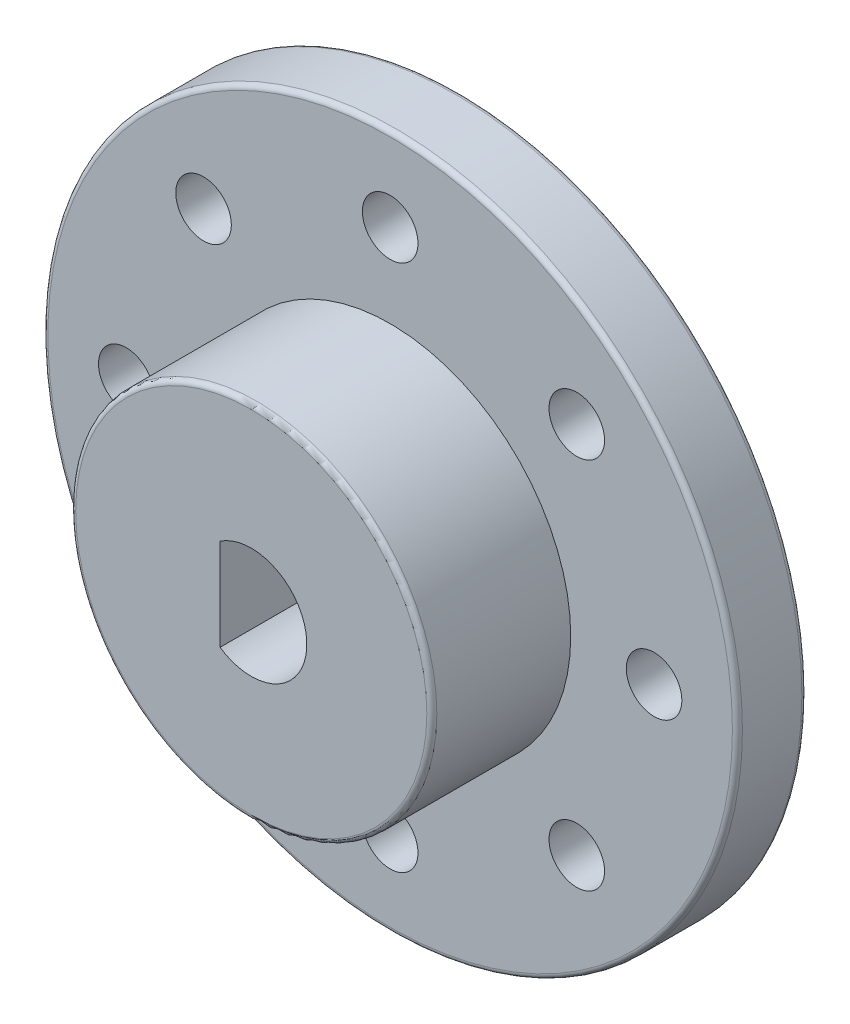
ISO-10303-21;
HEADER;
FILE_DESCRIPTION(('STEP AP214'),'2;1');
FILE_NAME('part.step','',(''),(''),'','','');
FILE_SCHEMA(('AUTOMOTIVE_DESIGN { 1 0 10303 214 1 1 1 1 }'));
ENDSEC;
DATA;
#1=APPLICATION_CONTEXT('core data for automotive mechanical design processes');
#2=APPLICATION_PROTOCOL_DEFINITION('international standard','automotive_design',2000,#1);
#3=PRODUCT_CONTEXT('',#1,'mechanical');
#4=PRODUCT('Part','Part','',(#3));
#5=PRODUCT_RELATED_PRODUCT_CATEGORY('part','',(#4));
#6=PRODUCT_DEFINITION_FORMATION('','',#4);
#7=PRODUCT_DEFINITION_CONTEXT('part definition',#1,'design');
#8=PRODUCT_DEFINITION('design','',#6,#7);
#9=PRODUCT_DEFINITION_SHAPE('','',#8);
#10=(LENGTH_UNIT() NAMED_UNIT(*) SI_UNIT(.MILLI.,.METRE.));
#11=(NAMED_UNIT(*) PLANE_ANGLE_UNIT() SI_UNIT($,.RADIAN.));
#12=(NAMED_UNIT(*) SI_UNIT($,.STERADIAN.) SOLID_ANGLE_UNIT());
#13=UNCERTAINTY_MEASURE_WITH_UNIT(LENGTH_MEASURE(1.E-05),#10,'distance_accuracy_value','');
#14=(GEOMETRIC_REPRESENTATION_CONTEXT(3) GLOBAL_UNCERTAINTY_ASSIGNED_CONTEXT((#13)) GLOBAL_UNIT_ASSIGNED_CONTEXT((#10,
#11,#12)) REPRESENTATION_CONTEXT('',''));
#15=CARTESIAN_POINT('',(0.,0.,0.));
#16=DIRECTION('',(0.,0.,1.));
#17=DIRECTION('',(1.,0.,0.));
#18=AXIS2_PLACEMENT_3D('',#15,#16,#17);
#19=CARTESIAN_POINT('',(0.,0.,5.));
#20=DIRECTION('',(0.,0.,1.));
#21=DIRECTION('',(1.,0.,0.));
#22=AXIS2_PLACEMENT_3D('',#19,#20,#21);
#23=PLANE('',#22);
#24=CARTESIAN_POINT('',(0.,0.,5.));
#25=DIRECTION('',(0.,0.,1.));
#26=DIRECTION('',(1.,0.,0.));
#27=AXIS2_PLACEMENT_3D('',#24,#25,#26);
#28=CIRCLE('',#27,24.64);
#29=CARTESIAN_POINT('',(24.64,0.,5.));
#30=VERTEX_POINT('',#29);
#31=EDGE_CURVE('E138',#30,#30,#28,.T.);
#32=ORIENTED_EDGE('',*,*,#31,.T.);
#33=EDGE_LOOP('',(#32));
#34=FACE_BOUND('',#33,.T.);
#35=CARTESIAN_POINT('',(0.,19.,5.));
#36=DIRECTION('',(0.,0.,1.));
#37=DIRECTION('',(1.,0.,0.));
#38=AXIS2_PLACEMENT_3D('',#35,#36,#37);
#39=CIRCLE('',#38,2.);
#40=CARTESIAN_POINT('',(2.,19.,5.));
#41=VERTEX_POINT('',#40);
#42=EDGE_CURVE('E102',#41,#41,#39,.T.);
#43=ORIENTED_EDGE('',*,*,#42,.F.);
#44=EDGE_LOOP('',(#43));
#45=FACE_BOUND('',#44,.T.);
#46=CARTESIAN_POINT('',(13.4350288425444,13.4350288425444,5.));
#47=DIRECTION('',(0.,0.,1.));
#48=DIRECTION('',(1.,0.,0.));
#49=AXIS2_PLACEMENT_3D('',#46,#47,#48);
#50=CIRCLE('',#49,2.);
#51=CARTESIAN_POINT('',(15.4350288425444,13.4350288425444,5.));
#52=VERTEX_POINT('',#51);
#53=EDGE_CURVE('E239',#52,#52,#50,.T.);
#54=ORIENTED_EDGE('',*,*,#53,.F.);
#55=EDGE_LOOP('',(#54));
#56=FACE_BOUND('',#55,.T.);
#57=CARTESIAN_POINT('',(19.,0.,5.));
#58=DIRECTION('',(0.,0.,1.));
#59=DIRECTION('',(1.,0.,0.));
#60=AXIS2_PLACEMENT_3D('',#57,#58,#59);
#61=CIRCLE('',#60,2.);
#62=CARTESIAN_POINT('',(21.,0.,5.));
#63=VERTEX_POINT('',#62);
#64=EDGE_CURVE('E235',#63,#63,#61,.T.);
#65=ORIENTED_EDGE('',*,*,#64,.F.);
#66=EDGE_LOOP('',(#65));
#67=FACE_BOUND('',#66,.T.);
#68=CARTESIAN_POINT('',(13.4350288425443,-13.4350288425445,5.));
#69=DIRECTION('',(0.,0.,1.));
#70=DIRECTION('',(1.,0.,0.));
#71=AXIS2_PLACEMENT_3D('',#68,#69,#70);
#72=CIRCLE('',#71,2.);
#73=CARTESIAN_POINT('',(15.4350288425443,-13.4350288425445,5.));
#74=VERTEX_POINT('',#73);
#75=EDGE_CURVE('E231',#74,#74,#72,.T.);
#76=ORIENTED_EDGE('',*,*,#75,.F.);
#77=EDGE_LOOP('',(#76));
#78=FACE_BOUND('',#77,.T.);
#79=CARTESIAN_POINT('',(-1.32676290876039E-13,-19.,5.));
#80=DIRECTION('',(0.,0.,1.));
#81=DIRECTION('',(1.,0.,0.));
#82=AXIS2_PLACEMENT_3D('',#79,#80,#81);
#83=CIRCLE('',#82,2.);
#84=CARTESIAN_POINT('',(1.99999999999987,-19.,5.));
#85=VERTEX_POINT('',#84);
#86=EDGE_CURVE('E227',#85,#85,#83,.T.);
#87=ORIENTED_EDGE('',*,*,#86,.F.);
#88=EDGE_LOOP('',(#87));
#89=FACE_BOUND('',#88,.T.);
#90=CARTESIAN_POINT('',(-13.4350288425445,-13.4350288425443,5.));
#91=DIRECTION('',(0.,0.,1.));
#92=DIRECTION('',(1.,0.,0.));
#93=AXIS2_PLACEMENT_3D('',#90,#91,#92);
#94=CIRCLE('',#93,2.);
#95=CARTESIAN_POINT('',(-11.4350288425445,-13.4350288425443,5.));
#96=VERTEX_POINT('',#95);
#97=EDGE_CURVE('E223',#96,#96,#94,.T.);
#98=ORIENTED_EDGE('',*,*,#97,.F.);
#99=EDGE_LOOP('',(#98));
#100=FACE_BOUND('',#99,.T.);
#101=CARTESIAN_POINT('',(-19.,1.99014436314059E-13,5.));
#102=DIRECTION('',(0.,0.,1.));
#103=DIRECTION('',(1.,0.,0.));
#104=AXIS2_PLACEMENT_3D('',#101,#102,#103);
#105=CIRCLE('',#104,2.);
#106=CARTESIAN_POINT('',(-17.,1.99014436314059E-13,5.));
#107=VERTEX_POINT('',#106);
#108=EDGE_CURVE('E219',#107,#107,#105,.T.);
#109=ORIENTED_EDGE('',*,*,#108,.F.);
#110=EDGE_LOOP('',(#109));
#111=FACE_BOUND('',#110,.T.);
#112=CARTESIAN_POINT('',(-13.4350288425442,13.4350288425446,5.));
#113=DIRECTION('',(0.,0.,1.));
#114=DIRECTION('',(1.,0.,0.));
#115=AXIS2_PLACEMENT_3D('',#112,#113,#114);
#116=CIRCLE('',#115,2.);
#117=CARTESIAN_POINT('',(-11.4350288425442,13.4350288425446,5.));
#118=VERTEX_POINT('',#117);
#119=EDGE_CURVE('E215',#118,#118,#116,.T.);
#120=ORIENTED_EDGE('',*,*,#119,.F.);
#121=EDGE_LOOP('',(#120));
#122=FACE_BOUND('',#121,.T.);
#123=CARTESIAN_POINT('',(0.,0.,5.));
#124=DIRECTION('',(0.,0.,1.));
#125=DIRECTION('',(1.,0.,0.));
#126=AXIS2_PLACEMENT_3D('',#123,#124,#125);
#127=CIRCLE('',#126,13.);
#128=CARTESIAN_POINT('',(13.,0.,5.));
#129=VERTEX_POINT('',#128);
#130=EDGE_CURVE('E129',#129,#129,#127,.T.);
#131=ORIENTED_EDGE('',*,*,#130,.F.);
#132=EDGE_LOOP('',(#131));
#133=FACE_BOUND('',#132,.T.);
#134=ADVANCED_FACE('F45',(#34,#45,#56,#67,#78,#89,#100,#111,#122,#133),#23,.T.);
#135=CARTESIAN_POINT('',(0.,0.,0.));
#136=DIRECTION('',(0.,0.,1.));
#137=DIRECTION('',(1.,0.,0.));
#138=AXIS2_PLACEMENT_3D('',#135,#136,#137);
#139=PLANE('',#138);
#140=CARTESIAN_POINT('',(0.,0.,0.));
#141=DIRECTION('',(0.,0.,1.));
#142=DIRECTION('',(1.,0.,0.));
#143=AXIS2_PLACEMENT_3D('',#140,#141,#142);
#144=CIRCLE('',#143,24.64);
#145=CARTESIAN_POINT('',(24.64,0.,0.));
#146=VERTEX_POINT('',#145);
#147=EDGE_CURVE('E134',#146,#146,#144,.F.);
#148=ORIENTED_EDGE('',*,*,#147,.T.);
#149=EDGE_LOOP('',(#148));
#150=FACE_BOUND('',#149,.T.);
#151=CARTESIAN_POINT('',(0.,19.,0.));
#152=DIRECTION('',(0.,0.,1.));
#153=DIRECTION('',(1.,0.,0.));
#154=AXIS2_PLACEMENT_3D('',#151,#152,#153);
#155=CIRCLE('',#154,2.);
#156=CARTESIAN_POINT('',(2.,19.,0.));
#157=VERTEX_POINT('',#156);
#158=EDGE_CURVE('E126',#157,#157,#155,.T.);
#159=ORIENTED_EDGE('',*,*,#158,.T.);
#160=EDGE_LOOP('',(#159));
#161=FACE_BOUND('',#160,.T.);
#162=CARTESIAN_POINT('',(13.4350288425444,13.4350288425444,0.));
#163=DIRECTION('',(0.,0.,1.));
#164=DIRECTION('',(1.,0.,0.));
#165=AXIS2_PLACEMENT_3D('',#162,#163,#164);
#166=CIRCLE('',#165,2.);
#167=CARTESIAN_POINT('',(15.4350288425444,13.4350288425444,0.));
#168=VERTEX_POINT('',#167);
#169=EDGE_CURVE('E122',#168,#168,#166,.T.);
#170=ORIENTED_EDGE('',*,*,#169,.T.);
#171=EDGE_LOOP('',(#170));
#172=FACE_BOUND('',#171,.T.);
#173=CARTESIAN_POINT('',(19.,0.,0.));
#174=DIRECTION('',(0.,0.,1.));
#175=DIRECTION('',(1.,0.,0.));
#176=AXIS2_PLACEMENT_3D('',#173,#174,#175);
#177=CIRCLE('',#176,2.);
#178=CARTESIAN_POINT('',(21.,0.,0.));
#179=VERTEX_POINT('',#178);
#180=EDGE_CURVE('E118',#179,#179,#177,.T.);
#181=ORIENTED_EDGE('',*,*,#180,.T.);
#182=EDGE_LOOP('',(#181));
#183=FACE_BOUND('',#182,.T.);
#184=CARTESIAN_POINT('',(13.4350288425443,-13.4350288425445,0.));
#185=DIRECTION('',(0.,0.,1.));
#186=DIRECTION('',(1.,0.,0.));
#187=AXIS2_PLACEMENT_3D('',#184,#185,#186);
#188=CIRCLE('',#187,2.);
#189=CARTESIAN_POINT('',(15.4350288425443,-13.4350288425445,0.));
#190=VERTEX_POINT('',#189);
#191=EDGE_CURVE('E114',#190,#190,#188,.T.);
#192=ORIENTED_EDGE('',*,*,#191,.T.);
#193=EDGE_LOOP('',(#192));
#194=FACE_BOUND('',#193,.T.);
#195=CARTESIAN_POINT('',(-1.32676290876039E-13,-19.,0.));
#196=DIRECTION('',(0.,0.,1.));
#197=DIRECTION('',(1.,0.,0.));
#198=AXIS2_PLACEMENT_3D('',#195,#196,#197);
#199=CIRCLE('',#198,2.);
#200=CARTESIAN_POINT('',(1.99999999999987,-19.,0.));
#201=VERTEX_POINT('',#200);
#202=EDGE_CURVE('E110',#201,#201,#199,.T.);
#203=ORIENTED_EDGE('',*,*,#202,.T.);
#204=EDGE_LOOP('',(#203));
#205=FACE_BOUND('',#204,.T.);
#206=CARTESIAN_POINT('',(-13.4350288425445,-13.4350288425443,0.));
#207=DIRECTION('',(0.,0.,1.));
#208=DIRECTION('',(1.,0.,0.));
#209=AXIS2_PLACEMENT_3D('',#206,#207,#208);
#210=CIRCLE('',#209,2.);
#211=CARTESIAN_POINT('',(-11.4350288425445,-13.4350288425443,0.));
#212=VERTEX_POINT('',#211);
#213=EDGE_CURVE('E106',#212,#212,#210,.T.);
#214=ORIENTED_EDGE('',*,*,#213,.T.);
#215=EDGE_LOOP('',(#214));
#216=FACE_BOUND('',#215,.T.);
#217=CARTESIAN_POINT('',(-19.,1.99014436314059E-13,0.));
#218=DIRECTION('',(0.,0.,1.));
#219=DIRECTION('',(1.,0.,0.));
#220=AXIS2_PLACEMENT_3D('',#217,#218,#219);
#221=CIRCLE('',#220,2.);
#222=CARTESIAN_POINT('',(-17.,1.99014436314059E-13,0.));
#223=VERTEX_POINT('',#222);
#224=EDGE_CURVE('E101',#223,#223,#221,.T.);
#225=ORIENTED_EDGE('',*,*,#224,.T.);
#226=EDGE_LOOP('',(#225));
#227=FACE_BOUND('',#226,.T.);
#228=CARTESIAN_POINT('',(-13.4350288425442,13.4350288425446,0.));
#229=DIRECTION('',(0.,0.,1.));
#230=DIRECTION('',(1.,0.,0.));
#231=AXIS2_PLACEMENT_3D('',#228,#229,#230);
#232=CIRCLE('',#231,2.);
#233=CARTESIAN_POINT('',(-11.4350288425442,13.4350288425446,0.));
#234=VERTEX_POINT('',#233);
#235=EDGE_CURVE('E97',#234,#234,#232,.T.);
#236=ORIENTED_EDGE('',*,*,#235,.T.);
#237=EDGE_LOOP('',(#236));
#238=FACE_BOUND('',#237,.T.);
#239=CARTESIAN_POINT('',(0.,0.,0.));
#240=DIRECTION('',(0.,0.,1.));
#241=DIRECTION('',(1.,0.,0.));
#242=AXIS2_PLACEMENT_3D('',#239,#240,#241);
#243=CIRCLE('',#242,4.);
#244=CARTESIAN_POINT('',(-2.24747649488631,-3.30890456268137,0.));
#245=VERTEX_POINT('',#244);
#246=CARTESIAN_POINT('',(-2.24747649488631,3.30890456268136,0.));
#247=VERTEX_POINT('',#246);
#248=EDGE_CURVE('E68',#245,#247,#243,.T.);
#249=ORIENTED_EDGE('',*,*,#248,.T.);
#250=DIRECTION('',(0.,1.,0.));
#251=VECTOR('',#250,1.);
#252=CARTESIAN_POINT('',(-2.24747649488631,-3.30890456268137,0.));
#253=LINE('',#252,#251);
#254=EDGE_CURVE('E80',#245,#247,#253,.T.);
#255=ORIENTED_EDGE('',*,*,#254,.F.);
#256=EDGE_LOOP('',(#249,#255));
#257=FACE_BOUND('',#256,.T.);
#258=ADVANCED_FACE('F156',(#150,#161,#172,#183,#194,#205,#216,#227,#238,#257),#139,.F.);
#259=CARTESIAN_POINT('',(0.,0.,5.));
#260=DIRECTION('',(0.,0.,-1.));
#261=DIRECTION('',(-1.,0.,0.));
#262=AXIS2_PLACEMENT_3D('',#259,#260,#261);
#263=CYLINDRICAL_SURFACE('',#262,25.);
#264=CARTESIAN_POINT('',(0.,0.,0.36));
#265=DIRECTION('',(0.,0.,1.));
#266=DIRECTION('',(1.,0.,0.));
#267=AXIS2_PLACEMENT_3D('',#264,#265,#266);
#268=CIRCLE('',#267,25.);
#269=CARTESIAN_POINT('',(25.,0.,0.36));
#270=VERTEX_POINT('',#269);
#271=EDGE_CURVE('E93',#270,#270,#268,.T.);
#272=ORIENTED_EDGE('',*,*,#271,.T.);
#273=EDGE_LOOP('',(#272));
#274=FACE_BOUND('',#273,.T.);
#275=CARTESIAN_POINT('',(0.,0.,4.64));
#276=DIRECTION('',(0.,0.,1.));
#277=DIRECTION('',(1.,0.,0.));
#278=AXIS2_PLACEMENT_3D('',#275,#276,#277);
#279=CIRCLE('',#278,25.);
#280=CARTESIAN_POINT('',(25.,0.,4.64));
#281=VERTEX_POINT('',#280);
#282=EDGE_CURVE('E89',#281,#281,#279,.F.);
#283=ORIENTED_EDGE('',*,*,#282,.T.);
#284=EDGE_LOOP('',(#283));
#285=FACE_BOUND('',#284,.T.);
#286=ADVANCED_FACE('F163',(#274,#285),#263,.T.);
#287=CARTESIAN_POINT('',(0.,0.,5.));
#288=DIRECTION('',(0.,0.,-1.));
#289=DIRECTION('',(-1.,0.,0.));
#290=AXIS2_PLACEMENT_3D('',#287,#288,#289);
#291=CYLINDRICAL_SURFACE('',#290,4.);
#292=DIRECTION('',(0.,0.,1.));
#293=VECTOR('',#292,1.);
#294=CARTESIAN_POINT('',(-2.24747649488631,-3.30890456268137,0.));
#295=LINE('',#294,#293);
#296=CARTESIAN_POINT('',(-2.24747649488631,-3.30890456268137,15.));
#297=VERTEX_POINT('',#296);
#298=EDGE_CURVE('E73',#245,#297,#295,.T.);
#299=ORIENTED_EDGE('',*,*,#298,.T.);
#300=CARTESIAN_POINT('',(0.,0.,15.));
#301=DIRECTION('',(0.,0.,1.));
#302=DIRECTION('',(1.,0.,0.));
#303=AXIS2_PLACEMENT_3D('',#300,#301,#302);
#304=CIRCLE('',#303,4.);
#305=CARTESIAN_POINT('',(-2.24747649488631,3.30890456268136,15.));
#306=VERTEX_POINT('',#305);
#307=EDGE_CURVE('E76',#297,#306,#304,.T.);
#308=ORIENTED_EDGE('',*,*,#307,.T.);
#309=DIRECTION('',(0.,0.,1.));
#310=VECTOR('',#309,1.);
#311=CARTESIAN_POINT('',(-2.24747649488631,3.30890456268136,0.));
#312=LINE('',#311,#310);
#313=EDGE_CURVE('E61',#247,#306,#312,.T.);
#314=ORIENTED_EDGE('',*,*,#313,.F.);
#315=ORIENTED_EDGE('',*,*,#248,.F.);
#316=EDGE_LOOP('',(#299,#308,#314,#315));
#317=FACE_BOUND('',#316,.T.);
#318=ADVANCED_FACE('F74',(#317),#291,.F.);
#319=CARTESIAN_POINT('',(-2.24747649488631,-3.30890456268137,0.));
#320=DIRECTION('',(1.,0.,0.));
#321=DIRECTION('',(0.,1.,0.));
#322=AXIS2_PLACEMENT_3D('',#319,#320,#321);
#323=PLANE('',#322);
#324=ORIENTED_EDGE('',*,*,#313,.T.);
#325=DIRECTION('',(0.,-1.,0.));
#326=VECTOR('',#325,1.);
#327=CARTESIAN_POINT('',(-2.24747649488631,0.,15.));
#328=LINE('',#327,#326);
#329=EDGE_CURVE('E82',#306,#297,#328,.T.);
#330=ORIENTED_EDGE('',*,*,#329,.T.);
#331=ORIENTED_EDGE('',*,*,#298,.F.);
#332=ORIENTED_EDGE('',*,*,#254,.T.);
#333=EDGE_LOOP('',(#324,#330,#331,#332));
#334=FACE_BOUND('',#333,.T.);
#335=ADVANCED_FACE('F83',(#334),#323,.T.);
#336=CARTESIAN_POINT('',(0.,0.,15.));
#337=DIRECTION('',(0.,0.,-1.));
#338=DIRECTION('',(-1.,0.,0.));
#339=AXIS2_PLACEMENT_3D('',#336,#337,#338);
#340=CYLINDRICAL_SURFACE('',#339,13.);
#341=CARTESIAN_POINT('',(0.,0.,14.64));
#342=DIRECTION('',(0.,0.,1.));
#343=DIRECTION('',(1.,0.,0.));
#344=AXIS2_PLACEMENT_3D('',#341,#342,#343);
#345=CIRCLE('',#344,13.);
#346=CARTESIAN_POINT('',(13.,0.,14.64));
#347=VERTEX_POINT('',#346);
#348=EDGE_CURVE('E11',#347,#347,#345,.F.);
#349=ORIENTED_EDGE('',*,*,#348,.T.);
#350=EDGE_LOOP('',(#349));
#351=FACE_BOUND('',#350,.T.);
#352=ORIENTED_EDGE('',*,*,#130,.T.);
#353=EDGE_LOOP('',(#352));
#354=FACE_BOUND('',#353,.T.);
#355=ADVANCED_FACE('F264',(#351,#354),#340,.T.);
#356=CARTESIAN_POINT('',(0.,0.,15.));
#357=DIRECTION('',(0.,0.,1.));
#358=DIRECTION('',(1.,0.,0.));
#359=AXIS2_PLACEMENT_3D('',#356,#357,#358);
#360=PLANE('',#359);
#361=CARTESIAN_POINT('',(0.,0.,15.));
#362=DIRECTION('',(0.,0.,1.));
#363=DIRECTION('',(1.,0.,0.));
#364=AXIS2_PLACEMENT_3D('',#361,#362,#363);
#365=CIRCLE('',#364,12.64);
#366=CARTESIAN_POINT('',(12.64,0.,15.));
#367=VERTEX_POINT('',#366);
#368=EDGE_CURVE('E54',#367,#367,#365,.T.);
#369=ORIENTED_EDGE('',*,*,#368,.T.);
#370=EDGE_LOOP('',(#369));
#371=FACE_BOUND('',#370,.T.);
#372=ORIENTED_EDGE('',*,*,#307,.F.);
#373=ORIENTED_EDGE('',*,*,#329,.F.);
#374=EDGE_LOOP('',(#372,#373));
#375=FACE_BOUND('',#374,.T.);
#376=ADVANCED_FACE('F87',(#371,#375),#360,.T.);
#377=CARTESIAN_POINT('',(-13.4350288425442,13.4350288425446,-13.));
#378=DIRECTION('',(0.,0.,1.));
#379=DIRECTION('',(1.,0.,0.));
#380=AXIS2_PLACEMENT_3D('',#377,#378,#379);
#381=CYLINDRICAL_SURFACE('',#380,2.);
#382=ORIENTED_EDGE('',*,*,#119,.T.);
#383=EDGE_LOOP('',(#382));
#384=FACE_BOUND('',#383,.T.);
#385=ORIENTED_EDGE('',*,*,#235,.F.);
#386=EDGE_LOOP('',(#385));
#387=FACE_BOUND('',#386,.T.);
#388=ADVANCED_FACE('F270',(#384,#387),#381,.F.);
#389=CARTESIAN_POINT('',(-19.,1.99014436314059E-13,-13.));
#390=DIRECTION('',(0.,0.,1.));
#391=DIRECTION('',(1.,0.,0.));
#392=AXIS2_PLACEMENT_3D('',#389,#390,#391);
#393=CYLINDRICAL_SURFACE('',#392,2.);
#394=ORIENTED_EDGE('',*,*,#108,.T.);
#395=EDGE_LOOP('',(#394));
#396=FACE_BOUND('',#395,.T.);
#397=ORIENTED_EDGE('',*,*,#224,.F.);
#398=EDGE_LOOP('',(#397));
#399=FACE_BOUND('',#398,.T.);
#400=ADVANCED_FACE('F276',(#396,#399),#393,.F.);
#401=CARTESIAN_POINT('',(-13.4350288425445,-13.4350288425443,-13.));
#402=DIRECTION('',(0.,0.,1.));
#403=DIRECTION('',(1.,0.,0.));
#404=AXIS2_PLACEMENT_3D('',#401,#402,#403);
#405=CYLINDRICAL_SURFACE('',#404,2.);
#406=ORIENTED_EDGE('',*,*,#97,.T.);
#407=EDGE_LOOP('',(#406));
#408=FACE_BOUND('',#407,.T.);
#409=ORIENTED_EDGE('',*,*,#213,.F.);
#410=EDGE_LOOP('',(#409));
#411=FACE_BOUND('',#410,.T.);
#412=ADVANCED_FACE('F280',(#408,#411),#405,.F.);
#413=CARTESIAN_POINT('',(-1.32676290876039E-13,-19.,-13.));
#414=DIRECTION('',(0.,0.,1.));
#415=DIRECTION('',(1.,0.,0.));
#416=AXIS2_PLACEMENT_3D('',#413,#414,#415);
#417=CYLINDRICAL_SURFACE('',#416,2.);
#418=ORIENTED_EDGE('',*,*,#86,.T.);
#419=EDGE_LOOP('',(#418));
#420=FACE_BOUND('',#419,.T.);
#421=ORIENTED_EDGE('',*,*,#202,.F.);
#422=EDGE_LOOP('',(#421));
#423=FACE_BOUND('',#422,.T.);
#424=ADVANCED_FACE('F284',(#420,#423),#417,.F.);
#425=CARTESIAN_POINT('',(13.4350288425443,-13.4350288425445,-13.));
#426=DIRECTION('',(0.,0.,1.));
#427=DIRECTION('',(1.,0.,0.));
#428=AXIS2_PLACEMENT_3D('',#425,#426,#427);
#429=CYLINDRICAL_SURFACE('',#428,2.);
#430=ORIENTED_EDGE('',*,*,#75,.T.);
#431=EDGE_LOOP('',(#430));
#432=FACE_BOUND('',#431,.T.);
#433=ORIENTED_EDGE('',*,*,#191,.F.);
#434=EDGE_LOOP('',(#433));
#435=FACE_BOUND('',#434,.T.);
#436=ADVANCED_FACE('F288',(#432,#435),#429,.F.);
#437=CARTESIAN_POINT('',(19.,0.,-13.));
#438=DIRECTION('',(0.,0.,1.));
#439=DIRECTION('',(1.,0.,0.));
#440=AXIS2_PLACEMENT_3D('',#437,#438,#439);
#441=CYLINDRICAL_SURFACE('',#440,2.);
#442=ORIENTED_EDGE('',*,*,#64,.T.);
#443=EDGE_LOOP('',(#442));
#444=FACE_BOUND('',#443,.T.);
#445=ORIENTED_EDGE('',*,*,#180,.F.);
#446=EDGE_LOOP('',(#445));
#447=FACE_BOUND('',#446,.T.);
#448=ADVANCED_FACE('F292',(#444,#447),#441,.F.);
#449=CARTESIAN_POINT('',(13.4350288425444,13.4350288425444,-13.));
#450=DIRECTION('',(0.,0.,1.));
#451=DIRECTION('',(1.,0.,0.));
#452=AXIS2_PLACEMENT_3D('',#449,#450,#451);
#453=CYLINDRICAL_SURFACE('',#452,2.);
#454=ORIENTED_EDGE('',*,*,#53,.T.);
#455=EDGE_LOOP('',(#454));
#456=FACE_BOUND('',#455,.T.);
#457=ORIENTED_EDGE('',*,*,#169,.F.);
#458=EDGE_LOOP('',(#457));
#459=FACE_BOUND('',#458,.T.);
#460=ADVANCED_FACE('F179',(#456,#459),#453,.F.);
#461=CARTESIAN_POINT('',(0.,19.,-13.));
#462=DIRECTION('',(0.,0.,1.));
#463=DIRECTION('',(1.,0.,0.));
#464=AXIS2_PLACEMENT_3D('',#461,#462,#463);
#465=CYLINDRICAL_SURFACE('',#464,2.);
#466=ORIENTED_EDGE('',*,*,#42,.T.);
#467=EDGE_LOOP('',(#466));
#468=FACE_BOUND('',#467,.T.);
#469=ORIENTED_EDGE('',*,*,#158,.F.);
#470=EDGE_LOOP('',(#469));
#471=FACE_BOUND('',#470,.T.);
#472=ADVANCED_FACE('F174',(#468,#471),#465,.F.);
#473=CARTESIAN_POINT('',(0.,0.,0.36));
#474=DIRECTION('',(0.,0.,1.));
#475=DIRECTION('',(1.,0.,0.));
#476=AXIS2_PLACEMENT_3D('',#473,#474,#475);
#477=TOROIDAL_SURFACE('',#476,24.64,0.36);
#478=ORIENTED_EDGE('',*,*,#147,.F.);
#479=EDGE_LOOP('',(#478));
#480=FACE_BOUND('',#479,.T.);
#481=ORIENTED_EDGE('',*,*,#271,.F.);
#482=EDGE_LOOP('',(#481));
#483=FACE_BOUND('',#482,.T.);
#484=ADVANCED_FACE('F152',(#480,#483),#477,.T.);
#485=CARTESIAN_POINT('',(0.,0.,4.64));
#486=DIRECTION('',(0.,0.,1.));
#487=DIRECTION('',(1.,0.,0.));
#488=AXIS2_PLACEMENT_3D('',#485,#486,#487);
#489=TOROIDAL_SURFACE('',#488,24.64,0.36);
#490=ORIENTED_EDGE('',*,*,#282,.F.);
#491=EDGE_LOOP('',(#490));
#492=FACE_BOUND('',#491,.T.);
#493=ORIENTED_EDGE('',*,*,#31,.F.);
#494=EDGE_LOOP('',(#493));
#495=FACE_BOUND('',#494,.T.);
#496=ADVANCED_FACE('F147',(#492,#495),#489,.T.);
#497=CARTESIAN_POINT('',(0.,0.,14.64));
#498=DIRECTION('',(0.,0.,1.));
#499=DIRECTION('',(1.,0.,0.));
#500=AXIS2_PLACEMENT_3D('',#497,#498,#499);
#501=TOROIDAL_SURFACE('',#500,12.64,0.36);
#502=ORIENTED_EDGE('',*,*,#348,.F.);
#503=EDGE_LOOP('',(#502));
#504=FACE_BOUND('',#503,.T.);
#505=ORIENTED_EDGE('',*,*,#368,.F.);
#506=EDGE_LOOP('',(#505));
#507=FACE_BOUND('',#506,.T.);
#508=ADVANCED_FACE('F47',(#504,#507),#501,.T.);
#509=CLOSED_SHELL('',(#134,#258,#286,#318,#335,#355,#376,#388,#400,#412,#424,#436,#448,#460,
#472,#484,#496,#508));
#510=MANIFOLD_SOLID_BREP('B2',#509);
#511=ADVANCED_BREP_SHAPE_REPRESENTATION('',(#18,#510),#14);
#512=SHAPE_DEFINITION_REPRESENTATION(#9,#511);
ENDSEC;
END-ISO-10303-21;
